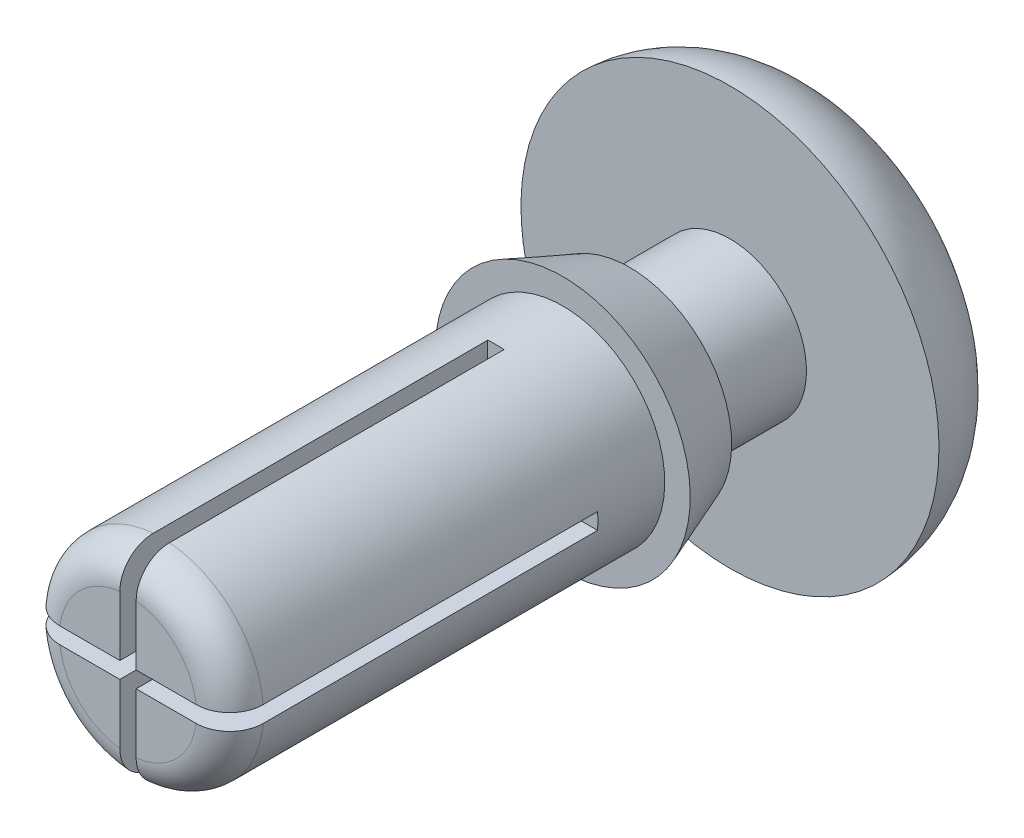
ISO-10303-21;
HEADER;
FILE_DESCRIPTION(('STEP AP214'),'2;1');
FILE_NAME('part.step','',(''),(''),'','','');
FILE_SCHEMA(('AUTOMOTIVE_DESIGN { 1 0 10303 214 1 1 1 1 }'));
ENDSEC;
DATA;
#1=APPLICATION_CONTEXT('core data for automotive mechanical design processes');
#2=APPLICATION_PROTOCOL_DEFINITION('international standard','automotive_design',2000,#1);
#3=PRODUCT_CONTEXT('',#1,'mechanical');
#4=PRODUCT('Part','Part','',(#3));
#5=PRODUCT_RELATED_PRODUCT_CATEGORY('part','',(#4));
#6=PRODUCT_DEFINITION_FORMATION('','',#4);
#7=PRODUCT_DEFINITION_CONTEXT('part definition',#1,'design');
#8=PRODUCT_DEFINITION('design','',#6,#7);
#9=PRODUCT_DEFINITION_SHAPE('','',#8);
#10=(LENGTH_UNIT() NAMED_UNIT(*) SI_UNIT(.MILLI.,.METRE.));
#11=(NAMED_UNIT(*) PLANE_ANGLE_UNIT() SI_UNIT($,.RADIAN.));
#12=(NAMED_UNIT(*) SI_UNIT($,.STERADIAN.) SOLID_ANGLE_UNIT());
#13=UNCERTAINTY_MEASURE_WITH_UNIT(LENGTH_MEASURE(1.E-05),#10,'distance_accuracy_value','');
#14=(GEOMETRIC_REPRESENTATION_CONTEXT(3) GLOBAL_UNCERTAINTY_ASSIGNED_CONTEXT((#13)) GLOBAL_UNIT_ASSIGNED_CONTEXT((#10,
#11,#12)) REPRESENTATION_CONTEXT('',''));
#15=CARTESIAN_POINT('',(0.,0.,0.));
#16=DIRECTION('',(0.,0.,1.));
#17=DIRECTION('',(1.,0.,0.));
#18=AXIS2_PLACEMENT_3D('',#15,#16,#17);
#19=CARTESIAN_POINT('',(0.,1.5494,6.604));
#20=DIRECTION('',(0.,0.,-1.));
#21=DIRECTION('',(0.,1.,0.));
#22=AXIS2_PLACEMENT_3D('',#19,#20,#21);
#23=PLANE('',#22);
#24=DIRECTION('',(1.,0.,0.));
#25=VECTOR('',#24,1.);
#26=CARTESIAN_POINT('',(0.,0.123952000000001,6.604));
#27=LINE('',#26,#25);
#28=CARTESIAN_POINT('',(0.123952,0.123952000000001,6.604));
#29=VERTEX_POINT('',#28);
#30=CARTESIAN_POINT('',(1.03399703176363,0.123952000000001,6.604));
#31=VERTEX_POINT('',#30);
#32=EDGE_CURVE('E339',#29,#31,#27,.T.);
#33=ORIENTED_EDGE('',*,*,#32,.T.);
#34=CARTESIAN_POINT('',(0.,0.,6.604));
#35=DIRECTION('',(0.,0.,-1.));
#36=DIRECTION('',(0.,1.,0.));
#37=AXIS2_PLACEMENT_3D('',#34,#35,#36);
#38=CIRCLE('',#37,1.0414);
#39=CARTESIAN_POINT('',(0.123952,1.03399703176363,6.604));
#40=VERTEX_POINT('',#39);
#41=EDGE_CURVE('E319',#31,#40,#38,.F.);
#42=ORIENTED_EDGE('',*,*,#41,.T.);
#43=DIRECTION('',(0.,-1.,0.));
#44=VECTOR('',#43,1.);
#45=CARTESIAN_POINT('',(0.123952,0.,6.604));
#46=LINE('',#45,#44);
#47=EDGE_CURVE('E338',#40,#29,#46,.T.);
#48=ORIENTED_EDGE('',*,*,#47,.T.);
#49=EDGE_LOOP('',(#33,#42,#48));
#50=FACE_BOUND('',#49,.T.);
#51=ADVANCED_FACE('F34',(#50),#23,.F.);
#52=DIRECTION('',(0.,-1.,0.));
#53=VECTOR('',#52,1.);
#54=CARTESIAN_POINT('',(0.123952,0.,6.604));
#55=LINE('',#54,#53);
#56=CARTESIAN_POINT('',(0.123952,-0.123951999999999,6.604));
#57=VERTEX_POINT('',#56);
#58=CARTESIAN_POINT('',(0.123952,-1.03399703176363,6.604));
#59=VERTEX_POINT('',#58);
#60=EDGE_CURVE('E353',#57,#59,#55,.T.);
#61=ORIENTED_EDGE('',*,*,#60,.T.);
#62=CARTESIAN_POINT('',(0.,0.,6.604));
#63=DIRECTION('',(0.,0.,-1.));
#64=DIRECTION('',(0.,1.,0.));
#65=AXIS2_PLACEMENT_3D('',#62,#63,#64);
#66=CIRCLE('',#65,1.0414);
#67=CARTESIAN_POINT('',(1.03399703176363,-0.123951999999999,6.604));
#68=VERTEX_POINT('',#67);
#69=EDGE_CURVE('E236',#59,#68,#66,.F.);
#70=ORIENTED_EDGE('',*,*,#69,.T.);
#71=DIRECTION('',(1.,0.,0.));
#72=VECTOR('',#71,1.);
#73=CARTESIAN_POINT('',(0.,-0.123951999999999,6.604));
#74=LINE('',#73,#72);
#75=EDGE_CURVE('E356',#57,#68,#74,.T.);
#76=ORIENTED_EDGE('',*,*,#75,.F.);
#77=EDGE_LOOP('',(#61,#70,#76));
#78=FACE_BOUND('',#77,.T.);
#79=ADVANCED_FACE('F369',(#78),#23,.F.);
#80=DIRECTION('',(0.,-1.,0.));
#81=VECTOR('',#80,1.);
#82=CARTESIAN_POINT('',(-0.123952,0.,6.604));
#83=LINE('',#82,#81);
#84=CARTESIAN_POINT('',(-0.123952,1.03399703176363,6.604));
#85=VERTEX_POINT('',#84);
#86=CARTESIAN_POINT('',(-0.123952,0.123952000000001,6.604));
#87=VERTEX_POINT('',#86);
#88=EDGE_CURVE('E179',#85,#87,#83,.T.);
#89=ORIENTED_EDGE('',*,*,#88,.F.);
#90=CARTESIAN_POINT('',(0.,0.,6.604));
#91=DIRECTION('',(0.,0.,-1.));
#92=DIRECTION('',(0.,1.,0.));
#93=AXIS2_PLACEMENT_3D('',#90,#91,#92);
#94=CIRCLE('',#93,1.0414);
#95=CARTESIAN_POINT('',(-1.03399703176363,0.123952000000001,6.604));
#96=VERTEX_POINT('',#95);
#97=EDGE_CURVE('E391',#85,#96,#94,.F.);
#98=ORIENTED_EDGE('',*,*,#97,.T.);
#99=DIRECTION('',(1.,0.,0.));
#100=VECTOR('',#99,1.);
#101=CARTESIAN_POINT('',(0.,0.123952000000001,6.604));
#102=LINE('',#101,#100);
#103=EDGE_CURVE('E343',#96,#87,#102,.T.);
#104=ORIENTED_EDGE('',*,*,#103,.T.);
#105=EDGE_LOOP('',(#89,#98,#104));
#106=FACE_BOUND('',#105,.T.);
#107=ADVANCED_FACE('F396',(#106),#23,.F.);
#108=CARTESIAN_POINT('',(0.,0.,6.604));
#109=DIRECTION('',(0.,0.,1.));
#110=DIRECTION('',(0.,-1.,0.));
#111=AXIS2_PLACEMENT_3D('',#108,#109,#110);
#112=CYLINDRICAL_SURFACE('',#111,1.5494);
#113=CARTESIAN_POINT('',(0.,0.,0.));
#114=DIRECTION('',(0.,0.,1.));
#115=DIRECTION('',(0.,-1.,0.));
#116=AXIS2_PLACEMENT_3D('',#113,#114,#115);
#117=CIRCLE('',#116,1.5494);
#118=CARTESIAN_POINT('',(0.,-1.5494,0.));
#119=VERTEX_POINT('',#118);
#120=EDGE_CURVE('E211',#119,#119,#117,.T.);
#121=ORIENTED_EDGE('',*,*,#120,.T.);
#122=EDGE_LOOP('',(#121));
#123=FACE_BOUND('',#122,.T.);
#124=DIRECTION('',(0.,0.,1.));
#125=VECTOR('',#124,1.);
#126=CARTESIAN_POINT('',(1.54443396158463,-0.123951999999999,6.604));
#127=LINE('',#126,#125);
#128=CARTESIAN_POINT('',(1.54443396158463,-0.123951999999999,1.016));
#129=VERTEX_POINT('',#128);
#130=CARTESIAN_POINT('',(1.54443396158463,-0.123951999999999,6.096));
#131=VERTEX_POINT('',#130);
#132=EDGE_CURVE('E216',#129,#131,#127,.T.);
#133=ORIENTED_EDGE('',*,*,#132,.T.);
#134=CARTESIAN_POINT('',(0.,0.,6.096));
#135=DIRECTION('',(0.,0.,-1.));
#136=DIRECTION('',(0.,1.,0.));
#137=AXIS2_PLACEMENT_3D('',#134,#135,#136);
#138=CIRCLE('',#137,1.5494);
#139=CARTESIAN_POINT('',(0.123952,-1.54443396158463,6.096));
#140=VERTEX_POINT('',#139);
#141=EDGE_CURVE('E278',#131,#140,#138,.T.);
#142=ORIENTED_EDGE('',*,*,#141,.T.);
#143=DIRECTION('',(0.,0.,1.));
#144=VECTOR('',#143,1.);
#145=CARTESIAN_POINT('',(0.123952,-1.54443396158463,6.604));
#146=LINE('',#145,#144);
#147=CARTESIAN_POINT('',(0.123952,-1.54443396158463,1.016));
#148=VERTEX_POINT('',#147);
#149=EDGE_CURVE('E225',#148,#140,#146,.T.);
#150=ORIENTED_EDGE('',*,*,#149,.F.);
#151=CARTESIAN_POINT('',(0.,0.,1.016));
#152=DIRECTION('',(0.,0.,1.));
#153=DIRECTION('',(1.,0.,0.));
#154=AXIS2_PLACEMENT_3D('',#151,#152,#153);
#155=CIRCLE('',#154,1.5494);
#156=CARTESIAN_POINT('',(-0.123952,-1.54443396158463,1.016));
#157=VERTEX_POINT('',#156);
#158=EDGE_CURVE('E217',#157,#148,#155,.T.);
#159=ORIENTED_EDGE('',*,*,#158,.F.);
#160=DIRECTION('',(0.,0.,1.));
#161=VECTOR('',#160,1.);
#162=CARTESIAN_POINT('',(-0.123952,-1.54443396158463,6.604));
#163=LINE('',#162,#161);
#164=CARTESIAN_POINT('',(-0.123952,-1.54443396158463,6.096));
#165=VERTEX_POINT('',#164);
#166=EDGE_CURVE('E222',#157,#165,#163,.T.);
#167=ORIENTED_EDGE('',*,*,#166,.T.);
#168=CARTESIAN_POINT('',(0.,0.,6.096));
#169=DIRECTION('',(0.,0.,-1.));
#170=DIRECTION('',(0.,1.,0.));
#171=AXIS2_PLACEMENT_3D('',#168,#169,#170);
#172=CIRCLE('',#171,1.5494);
#173=CARTESIAN_POINT('',(-1.54443396158463,-0.123951999999999,6.096));
#174=VERTEX_POINT('',#173);
#175=EDGE_CURVE('E379',#165,#174,#172,.T.);
#176=ORIENTED_EDGE('',*,*,#175,.T.);
#177=DIRECTION('',(0.,0.,1.));
#178=VECTOR('',#177,1.);
#179=CARTESIAN_POINT('',(-1.54443396158463,-0.123951999999999,6.604));
#180=LINE('',#179,#178);
#181=CARTESIAN_POINT('',(-1.54443396158463,-0.123951999999999,1.016));
#182=VERTEX_POINT('',#181);
#183=EDGE_CURVE('E230',#174,#182,#180,.F.);
#184=ORIENTED_EDGE('',*,*,#183,.T.);
#185=CARTESIAN_POINT('',(-1.54443396158463,0.123952000000001,1.016));
#186=VERTEX_POINT('',#185);
#187=EDGE_CURVE('E228',#186,#182,#155,.T.);
#188=ORIENTED_EDGE('',*,*,#187,.F.);
#189=DIRECTION('',(0.,0.,1.));
#190=VECTOR('',#189,1.);
#191=CARTESIAN_POINT('',(-1.54443396158463,0.123952000000001,6.604));
#192=LINE('',#191,#190);
#193=CARTESIAN_POINT('',(-1.54443396158463,0.123952000000001,6.096));
#194=VERTEX_POINT('',#193);
#195=EDGE_CURVE('E174',#194,#186,#192,.F.);
#196=ORIENTED_EDGE('',*,*,#195,.F.);
#197=CARTESIAN_POINT('',(0.,0.,6.096));
#198=DIRECTION('',(0.,0.,-1.));
#199=DIRECTION('',(0.,1.,0.));
#200=AXIS2_PLACEMENT_3D('',#197,#198,#199);
#201=CIRCLE('',#200,1.5494);
#202=CARTESIAN_POINT('',(-0.123952,1.54443396158463,6.096));
#203=VERTEX_POINT('',#202);
#204=EDGE_CURVE('E378',#194,#203,#201,.T.);
#205=ORIENTED_EDGE('',*,*,#204,.T.);
#206=DIRECTION('',(0.,0.,1.));
#207=VECTOR('',#206,1.);
#208=CARTESIAN_POINT('',(-0.123952,1.54443396158463,6.604));
#209=LINE('',#208,#207);
#210=CARTESIAN_POINT('',(-0.123952,1.54443396158463,1.016));
#211=VERTEX_POINT('',#210);
#212=EDGE_CURVE('E232',#203,#211,#209,.F.);
#213=ORIENTED_EDGE('',*,*,#212,.T.);
#214=CARTESIAN_POINT('',(0.123952,1.54443396158463,1.016));
#215=VERTEX_POINT('',#214);
#216=EDGE_CURVE('E162',#215,#211,#155,.T.);
#217=ORIENTED_EDGE('',*,*,#216,.F.);
#218=DIRECTION('',(0.,0.,1.));
#219=VECTOR('',#218,1.);
#220=CARTESIAN_POINT('',(0.123952,1.54443396158463,6.604));
#221=LINE('',#220,#219);
#222=CARTESIAN_POINT('',(0.123952,1.54443396158463,6.096));
#223=VERTEX_POINT('',#222);
#224=EDGE_CURVE('E234',#223,#215,#221,.F.);
#225=ORIENTED_EDGE('',*,*,#224,.F.);
#226=CARTESIAN_POINT('',(0.,0.,6.096));
#227=DIRECTION('',(0.,0.,-1.));
#228=DIRECTION('',(0.,1.,0.));
#229=AXIS2_PLACEMENT_3D('',#226,#227,#228);
#230=CIRCLE('',#229,1.5494);
#231=CARTESIAN_POINT('',(1.54443396158463,0.123952000000001,6.096));
#232=VERTEX_POINT('',#231);
#233=EDGE_CURVE('E247',#223,#232,#230,.T.);
#234=ORIENTED_EDGE('',*,*,#233,.T.);
#235=DIRECTION('',(0.,0.,1.));
#236=VECTOR('',#235,1.);
#237=CARTESIAN_POINT('',(1.54443396158463,0.123952000000001,6.604));
#238=LINE('',#237,#236);
#239=CARTESIAN_POINT('',(1.54443396158463,0.123952000000001,1.016));
#240=VERTEX_POINT('',#239);
#241=EDGE_CURVE('E220',#240,#232,#238,.T.);
#242=ORIENTED_EDGE('',*,*,#241,.F.);
#243=EDGE_CURVE('E214',#129,#240,#155,.T.);
#244=ORIENTED_EDGE('',*,*,#243,.F.);
#245=EDGE_LOOP('',(#133,#142,#150,#159,#167,#176,#184,#188,#196,#205,#213,#217,#225,#234,#242,#244));
#246=FACE_BOUND('',#245,.T.);
#247=ADVANCED_FACE('F374',(#123,#246),#112,.T.);
#248=CARTESIAN_POINT('',(0.,1.5875,-4.064));
#249=DIRECTION('',(0.,0.,1.));
#250=DIRECTION('',(0.,-1.,0.));
#251=AXIS2_PLACEMENT_3D('',#248,#249,#250);
#252=PLANE('',#251);
#253=CARTESIAN_POINT('',(0.,0.,-4.064));
#254=DIRECTION('',(0.,0.,1.));
#255=DIRECTION('',(0.,-1.,0.));
#256=AXIS2_PLACEMENT_3D('',#253,#254,#255);
#257=CIRCLE('',#256,1.5875);
#258=CARTESIAN_POINT('',(0.,-1.5875,-4.064));
#259=VERTEX_POINT('',#258);
#260=EDGE_CURVE('E192',#259,#259,#257,.T.);
#261=ORIENTED_EDGE('',*,*,#260,.F.);
#262=EDGE_LOOP('',(#261));
#263=FACE_BOUND('',#262,.T.);
#264=ADVANCED_FACE('F404',(#263),#252,.F.);
#265=DIRECTION('',(1.,0.,0.));
#266=VECTOR('',#265,1.);
#267=CARTESIAN_POINT('',(0.,-0.123951999999999,6.604));
#268=LINE('',#267,#266);
#269=CARTESIAN_POINT('',(-1.03399703176363,-0.123951999999999,6.604));
#270=VERTEX_POINT('',#269);
#271=CARTESIAN_POINT('',(-0.123952,-0.123951999999999,6.604));
#272=VERTEX_POINT('',#271);
#273=EDGE_CURVE('E348',#270,#272,#268,.T.);
#274=ORIENTED_EDGE('',*,*,#273,.F.);
#275=CARTESIAN_POINT('',(0.,0.,6.604));
#276=DIRECTION('',(0.,0.,-1.));
#277=DIRECTION('',(0.,1.,0.));
#278=AXIS2_PLACEMENT_3D('',#275,#276,#277);
#279=CIRCLE('',#278,1.0414);
#280=CARTESIAN_POINT('',(-0.123952,-1.03399703176363,6.604));
#281=VERTEX_POINT('',#280);
#282=EDGE_CURVE('E277',#270,#281,#279,.F.);
#283=ORIENTED_EDGE('',*,*,#282,.T.);
#284=DIRECTION('',(0.,-1.,0.));
#285=VECTOR('',#284,1.);
#286=CARTESIAN_POINT('',(-0.123952,0.,6.604));
#287=LINE('',#286,#285);
#288=EDGE_CURVE('E350',#272,#281,#287,.T.);
#289=ORIENTED_EDGE('',*,*,#288,.F.);
#290=EDGE_LOOP('',(#274,#283,#289));
#291=FACE_BOUND('',#290,.T.);
#292=ADVANCED_FACE('F399',(#291),#23,.F.);
#293=CARTESIAN_POINT('',(0.,1.93675,0.));
#294=DIRECTION('',(0.,0.,-1.));
#295=DIRECTION('',(0.,1.,0.));
#296=AXIS2_PLACEMENT_3D('',#293,#294,#295);
#297=PLANE('',#296);
#298=ORIENTED_EDGE('',*,*,#120,.F.);
#299=EDGE_LOOP('',(#298));
#300=FACE_BOUND('',#299,.T.);
#301=CARTESIAN_POINT('',(0.,0.,0.));
#302=DIRECTION('',(0.,0.,1.));
#303=DIRECTION('',(0.,-1.,0.));
#304=AXIS2_PLACEMENT_3D('',#301,#302,#303);
#305=CIRCLE('',#304,1.93675);
#306=CARTESIAN_POINT('',(0.,-1.93675,0.));
#307=VERTEX_POINT('',#306);
#308=EDGE_CURVE('E208',#307,#307,#305,.T.);
#309=ORIENTED_EDGE('',*,*,#308,.T.);
#310=EDGE_LOOP('',(#309));
#311=FACE_BOUND('',#310,.T.);
#312=ADVANCED_FACE('F408',(#300,#311),#297,.F.);
#313=CARTESIAN_POINT('',(0.,0.,-1.016));
#314=DIRECTION('',(0.,0.,1.));
#315=DIRECTION('',(0.,-1.,0.));
#316=AXIS2_PLACEMENT_3D('',#313,#314,#315);
#317=CONICAL_SURFACE('',#316,1.5494,0.364238831763668);
#318=ORIENTED_EDGE('',*,*,#308,.F.);
#319=EDGE_LOOP('',(#318));
#320=FACE_BOUND('',#319,.T.);
#321=CARTESIAN_POINT('',(0.,0.,-1.016));
#322=DIRECTION('',(0.,0.,1.));
#323=DIRECTION('',(0.,-1.,0.));
#324=AXIS2_PLACEMENT_3D('',#321,#322,#323);
#325=CIRCLE('',#324,1.5494);
#326=CARTESIAN_POINT('',(0.,-1.5494,-1.016));
#327=VERTEX_POINT('',#326);
#328=EDGE_CURVE('E205',#327,#327,#325,.T.);
#329=ORIENTED_EDGE('',*,*,#328,.T.);
#330=EDGE_LOOP('',(#329));
#331=FACE_BOUND('',#330,.T.);
#332=ADVANCED_FACE('F562',(#320,#331),#317,.T.);
#333=CARTESIAN_POINT('',(0.,1.16205,-1.016));
#334=DIRECTION('',(0.,0.,1.));
#335=DIRECTION('',(0.,-1.,0.));
#336=AXIS2_PLACEMENT_3D('',#333,#334,#335);
#337=PLANE('',#336);
#338=ORIENTED_EDGE('',*,*,#328,.F.);
#339=EDGE_LOOP('',(#338));
#340=FACE_BOUND('',#339,.T.);
#341=CARTESIAN_POINT('',(0.,0.,-1.016));
#342=DIRECTION('',(0.,0.,1.));
#343=DIRECTION('',(0.,-1.,0.));
#344=AXIS2_PLACEMENT_3D('',#341,#342,#343);
#345=CIRCLE('',#344,1.16205);
#346=CARTESIAN_POINT('',(0.,-1.16205,-1.016));
#347=VERTEX_POINT('',#346);
#348=EDGE_CURVE('E202',#347,#347,#345,.T.);
#349=ORIENTED_EDGE('',*,*,#348,.T.);
#350=EDGE_LOOP('',(#349));
#351=FACE_BOUND('',#350,.T.);
#352=ADVANCED_FACE('F552',(#340,#351),#337,.F.);
#353=CARTESIAN_POINT('',(0.,0.,6.604));
#354=DIRECTION('',(0.,0.,1.));
#355=DIRECTION('',(0.,-1.,0.));
#356=AXIS2_PLACEMENT_3D('',#353,#354,#355);
#357=CYLINDRICAL_SURFACE('',#356,1.16205);
#358=ORIENTED_EDGE('',*,*,#348,.F.);
#359=EDGE_LOOP('',(#358));
#360=FACE_BOUND('',#359,.T.);
#361=CARTESIAN_POINT('',(0.,0.,-2.54));
#362=DIRECTION('',(0.,0.,1.));
#363=DIRECTION('',(0.,-1.,0.));
#364=AXIS2_PLACEMENT_3D('',#361,#362,#363);
#365=CIRCLE('',#364,1.16205);
#366=CARTESIAN_POINT('',(0.,-1.16205,-2.54));
#367=VERTEX_POINT('',#366);
#368=EDGE_CURVE('E199',#367,#367,#365,.T.);
#369=ORIENTED_EDGE('',*,*,#368,.T.);
#370=EDGE_LOOP('',(#369));
#371=FACE_BOUND('',#370,.T.);
#372=ADVANCED_FACE('F543',(#360,#371),#357,.T.);
#373=CARTESIAN_POINT('',(0.,3.175,-2.54));
#374=DIRECTION('',(0.,0.,-1.));
#375=DIRECTION('',(0.,1.,0.));
#376=AXIS2_PLACEMENT_3D('',#373,#374,#375);
#377=PLANE('',#376);
#378=ORIENTED_EDGE('',*,*,#368,.F.);
#379=EDGE_LOOP('',(#378));
#380=FACE_BOUND('',#379,.T.);
#381=CARTESIAN_POINT('',(0.,0.,-2.54));
#382=DIRECTION('',(0.,0.,1.));
#383=DIRECTION('',(0.,-1.,0.));
#384=AXIS2_PLACEMENT_3D('',#381,#382,#383);
#385=CIRCLE('',#384,3.175);
#386=CARTESIAN_POINT('',(0.,-3.175,-2.54));
#387=VERTEX_POINT('',#386);
#388=EDGE_CURVE('E195',#387,#387,#385,.T.);
#389=ORIENTED_EDGE('',*,*,#388,.T.);
#390=EDGE_LOOP('',(#389));
#391=FACE_BOUND('',#390,.T.);
#392=ADVANCED_FACE('F534',(#380,#391),#377,.F.);
#393=CARTESIAN_POINT('',(0.,0.,-2.47517708333333));
#394=DIRECTION('',(0.,0.,1.));
#395=DIRECTION('',(0.,-1.,0.));
#396=AXIS2_PLACEMENT_3D('',#393,#394,#395);
#397=DEGENERATE_TOROIDAL_SURFACE('',#396,1.5875,1.58882291666667,.T.);
#398=ORIENTED_EDGE('',*,*,#388,.F.);
#399=EDGE_LOOP('',(#398));
#400=FACE_BOUND('',#399,.T.);
#401=ORIENTED_EDGE('',*,*,#260,.T.);
#402=EDGE_LOOP('',(#401));
#403=FACE_BOUND('',#402,.T.);
#404=ADVANCED_FACE('F328',(#400,#403),#397,.T.);
#405=CARTESIAN_POINT('',(0.123952,0.,1.016));
#406=DIRECTION('',(-1.,0.,0.));
#407=DIRECTION('',(0.,0.,1.));
#408=AXIS2_PLACEMENT_3D('',#405,#406,#407);
#409=PLANE('',#408);
#410=ORIENTED_EDGE('',*,*,#47,.F.);
#411=CARTESIAN_POINT('',(0.123952,1.03399703176363,6.604));
#412=CARTESIAN_POINT('',(0.123952,1.06283273116659,6.60402482893017));
#413=CARTESIAN_POINT('',(0.123952,1.09166420990576,6.60158092743518));
#414=CARTESIAN_POINT('',(0.123952,1.14850002839351,6.59191870748701));
#415=CARTESIAN_POINT('',(0.123952,1.17650481500354,6.58470301964545));
#416=CARTESIAN_POINT('',(0.123952,1.23091952370238,6.56565383936896));
#417=CARTESIAN_POINT('',(0.123952,1.25732841182211,6.55381738945009));
#418=CARTESIAN_POINT('',(0.123952,1.30776533212002,6.52586364353388));
#419=CARTESIAN_POINT('',(0.123952,1.33179398415613,6.50974746610287));
#420=CARTESIAN_POINT('',(0.123952,1.37668137694529,6.47376435601444));
#421=CARTESIAN_POINT('',(0.123952,1.39755366125537,6.45391431915702));
#422=CARTESIAN_POINT('',(0.123952,1.4356561295158,6.41097314114025));
#423=CARTESIAN_POINT('',(0.123952,1.45288558911708,6.38788135689921));
#424=CARTESIAN_POINT('',(0.123952,1.48313281201734,6.3392237494209));
#425=CARTESIAN_POINT('',(0.123952,1.49616781842471,6.31366863131571));
#426=CARTESIAN_POINT('',(0.123952,1.51774235977157,6.26073436905663));
#427=CARTESIAN_POINT('',(0.123952,1.52628477072618,6.23335640450974));
#428=CARTESIAN_POINT('',(0.123952,1.53643945658233,6.18750025863813));
#429=CARTESIAN_POINT('',(0.123952,1.53943567573503,6.16931667353443));
#430=CARTESIAN_POINT('',(0.123952,1.5434325679002,6.13275799448274));
#431=CARTESIAN_POINT('',(0.123952,1.5444361018787,6.1143832132267));
#432=CARTESIAN_POINT('',(0.123952,1.54443396158463,6.096));
#433=B_SPLINE_CURVE_WITH_KNOTS('',3,(#411,#412,#413,#414,#415,#416,#417,#418,#419,#420,#421,
#422,#423,#424,#425,#426,#427,#428,#429,#430,#431,#432),.UNSPECIFIED.,.F.,.F.,(4,2,2,2,2,2,2,2,
2,2,4),(0.,0.0863977700313253,0.17274794997644,0.259153488555823,0.34553646603467,
0.431537572846793,0.517555764300906,0.603215684139134,0.688820700296315,0.744005816427193,
0.799111643952221),.UNSPECIFIED.);
#434=EDGE_CURVE('E48',#40,#223,#433,.T.);
#435=ORIENTED_EDGE('',*,*,#434,.T.);
#436=ORIENTED_EDGE('',*,*,#224,.T.);
#437=DIRECTION('',(0.,-1.,0.));
#438=VECTOR('',#437,1.);
#439=CARTESIAN_POINT('',(0.123952,0.,1.016));
#440=LINE('',#439,#438);
#441=CARTESIAN_POINT('',(0.123952,0.123952000000001,1.016));
#442=VERTEX_POINT('',#441);
#443=EDGE_CURVE('E166',#215,#442,#440,.T.);
#444=ORIENTED_EDGE('',*,*,#443,.T.);
#445=DIRECTION('',(0.,0.,1.));
#446=VECTOR('',#445,1.);
#447=CARTESIAN_POINT('',(0.123952,0.123952000000001,1.016));
#448=LINE('',#447,#446);
#449=EDGE_CURVE('E196',#442,#29,#448,.T.);
#450=ORIENTED_EDGE('',*,*,#449,.T.);
#451=EDGE_LOOP('',(#410,#435,#436,#444,#450));
#452=FACE_BOUND('',#451,.T.);
#453=ADVANCED_FACE('F324',(#452),#409,.T.);
#454=CARTESIAN_POINT('',(0.,0.123952000000001,1.016));
#455=DIRECTION('',(0.,-1.,0.));
#456=DIRECTION('',(0.,0.,-1.));
#457=AXIS2_PLACEMENT_3D('',#454,#455,#456);
#458=PLANE('',#457);
#459=ORIENTED_EDGE('',*,*,#241,.T.);
#460=CARTESIAN_POINT('',(1.54443396158463,0.123952000000001,6.096));
#461=CARTESIAN_POINT('',(1.54445849180631,0.123952000000001,6.12450584479577));
#462=CARTESIAN_POINT('',(1.54202837061674,0.123952000000001,6.15300406473306));
#463=CARTESIAN_POINT('',(1.53244026996858,0.123952000000001,6.2091697615398));
#464=CARTESIAN_POINT('',(1.52528634385418,0.123952000000001,6.23683792939002));
#465=CARTESIAN_POINT('',(1.50642718968069,0.123952000000001,6.29059190688386));
#466=CARTESIAN_POINT('',(1.49471987787404,0.123952000000001,6.31667698573765));
#467=CARTESIAN_POINT('',(1.46710012618487,0.123952000000001,6.3665105013212));
#468=CARTESIAN_POINT('',(1.45118833981936,0.123952000000001,6.39025930040099));
#469=CARTESIAN_POINT('',(1.41559302474478,0.123952000000001,6.43478060631104));
#470=CARTESIAN_POINT('',(1.3959054262299,0.123952000000001,6.45554985898753));
#471=CARTESIAN_POINT('',(1.3533282044282,0.123952000000001,6.49350396522998));
#472=CARTESIAN_POINT('',(1.3304379939173,0.123952000000001,6.51068816000469));
#473=CARTESIAN_POINT('',(1.28203397842585,0.123952000000001,6.54104068239334));
#474=CARTESIAN_POINT('',(1.25651195698254,0.123952000000001,6.55419589103744));
#475=CARTESIAN_POINT('',(1.20363269334371,0.123952000000001,6.57605206564235));
#476=CARTESIAN_POINT('',(1.17627634145429,0.123952000000001,6.58475517501501));
#477=CARTESIAN_POINT('',(1.12963906652602,0.123952000000001,6.59540241636696));
#478=CARTESIAN_POINT('',(1.11063996142858,0.123952000000001,6.59862582428916));
#479=CARTESIAN_POINT('',(1.07242860845556,0.123952000000001,6.60292442128467));
#480=CARTESIAN_POINT('',(1.05321671595056,0.123952000000001,6.6040027691873));
#481=CARTESIAN_POINT('',(1.03399703176363,0.123952000000001,6.604));
#482=B_SPLINE_CURVE_WITH_KNOTS('',3,(#460,#461,#462,#463,#464,#465,#466,#467,#468,#469,#470,
#471,#472,#473,#474,#475,#476,#477,#478,#479,#480,#481),.UNSPECIFIED.,.F.,.F.,(4,2,2,2,2,2,2,2,
2,2,4),(0.,0.0854031376340935,0.170733088662268,0.256102134925247,0.341457919759495,
0.426906228765319,0.512370225973161,0.598109618248381,0.683807693341555,0.741506125600271,
0.799119527685795),.UNSPECIFIED.);
#483=EDGE_CURVE('E11',#232,#31,#482,.T.);
#484=ORIENTED_EDGE('',*,*,#483,.T.);
#485=ORIENTED_EDGE('',*,*,#32,.F.);
#486=ORIENTED_EDGE('',*,*,#449,.F.);
#487=DIRECTION('',(1.,0.,0.));
#488=VECTOR('',#487,1.);
#489=CARTESIAN_POINT('',(0.,0.123952000000001,1.016));
#490=LINE('',#489,#488);
#491=EDGE_CURVE('E182',#442,#240,#490,.T.);
#492=ORIENTED_EDGE('',*,*,#491,.T.);
#493=EDGE_LOOP('',(#459,#484,#485,#486,#492));
#494=FACE_BOUND('',#493,.T.);
#495=ADVANCED_FACE('F258',(#494),#458,.T.);
#496=CARTESIAN_POINT('',(0.,-0.123951999999999,1.016));
#497=DIRECTION('',(0.,-1.,0.));
#498=DIRECTION('',(0.,0.,-1.));
#499=AXIS2_PLACEMENT_3D('',#496,#497,#498);
#500=PLANE('',#499);
#501=ORIENTED_EDGE('',*,*,#75,.T.);
#502=CARTESIAN_POINT('',(1.03399703176363,-0.123951999999999,6.604));
#503=CARTESIAN_POINT('',(1.06283273116659,-0.123951999999999,6.60402482893017));
#504=CARTESIAN_POINT('',(1.09166420990576,-0.123951999999999,6.60158092743518));
#505=CARTESIAN_POINT('',(1.14850002839351,-0.123951999999999,6.59191870748701));
#506=CARTESIAN_POINT('',(1.17650481500354,-0.123951999999999,6.58470301964545));
#507=CARTESIAN_POINT('',(1.23091952370238,-0.123951999999999,6.56565383936896));
#508=CARTESIAN_POINT('',(1.25732841182212,-0.123951999999999,6.55381738945009));
#509=CARTESIAN_POINT('',(1.30776533212002,-0.123951999999999,6.52586364353388));
#510=CARTESIAN_POINT('',(1.33179398415613,-0.123951999999999,6.50974746610287));
#511=CARTESIAN_POINT('',(1.37668137694529,-0.123951999999999,6.47376435601444));
#512=CARTESIAN_POINT('',(1.39755366125537,-0.123951999999999,6.45391431915702));
#513=CARTESIAN_POINT('',(1.4356561295158,-0.123951999999999,6.41097314114025));
#514=CARTESIAN_POINT('',(1.45288558911709,-0.123951999999999,6.38788135689921));
#515=CARTESIAN_POINT('',(1.48313281201735,-0.123951999999999,6.3392237494209));
#516=CARTESIAN_POINT('',(1.49616781842471,-0.123951999999999,6.31366863131571));
#517=CARTESIAN_POINT('',(1.51774235977157,-0.123951999999999,6.26073436905663));
#518=CARTESIAN_POINT('',(1.52628477072618,-0.123951999999999,6.23335640450974));
#519=CARTESIAN_POINT('',(1.53643945658233,-0.123951999999999,6.18750025863813));
#520=CARTESIAN_POINT('',(1.53943567573503,-0.123951999999999,6.16931667353443));
#521=CARTESIAN_POINT('',(1.54343256790021,-0.123951999999999,6.13275799448274));
#522=CARTESIAN_POINT('',(1.5444361018787,-0.123951999999999,6.1143832132267));
#523=CARTESIAN_POINT('',(1.54443396158463,-0.123951999999999,6.096));
#524=B_SPLINE_CURVE_WITH_KNOTS('',3,(#502,#503,#504,#505,#506,#507,#508,#509,#510,#511,#512,
#513,#514,#515,#516,#517,#518,#519,#520,#521,#522,#523),.UNSPECIFIED.,.F.,.F.,(4,2,2,2,2,2,2,2,
2,2,4),(0.,0.0863977700313248,0.17274794997644,0.259153488555824,0.34553646603467,
0.431537572846792,0.517555764300906,0.603215684139133,0.688820700296315,0.744005816427194,
0.79911164395222),.UNSPECIFIED.);
#525=EDGE_CURVE('E239',#68,#131,#524,.T.);
#526=ORIENTED_EDGE('',*,*,#525,.T.);
#527=ORIENTED_EDGE('',*,*,#132,.F.);
#528=DIRECTION('',(1.,0.,0.));
#529=VECTOR('',#528,1.);
#530=CARTESIAN_POINT('',(0.,-0.123951999999999,1.016));
#531=LINE('',#530,#529);
#532=CARTESIAN_POINT('',(0.123952,-0.123951999999999,1.016));
#533=VERTEX_POINT('',#532);
#534=EDGE_CURVE('E188',#533,#129,#531,.T.);
#535=ORIENTED_EDGE('',*,*,#534,.F.);
#536=DIRECTION('',(0.,0.,1.));
#537=VECTOR('',#536,1.);
#538=CARTESIAN_POINT('',(0.123952,-0.123951999999999,1.016));
#539=LINE('',#538,#537);
#540=EDGE_CURVE('E185',#533,#57,#539,.T.);
#541=ORIENTED_EDGE('',*,*,#540,.T.);
#542=EDGE_LOOP('',(#501,#526,#527,#535,#541));
#543=FACE_BOUND('',#542,.T.);
#544=ADVANCED_FACE('F253',(#543),#500,.F.);
#545=CARTESIAN_POINT('',(0.123952,0.,1.016));
#546=DIRECTION('',(-1.,0.,0.));
#547=DIRECTION('',(0.,0.,1.));
#548=AXIS2_PLACEMENT_3D('',#545,#546,#547);
#549=PLANE('',#548);
#550=ORIENTED_EDGE('',*,*,#149,.T.);
#551=CARTESIAN_POINT('',(0.123952,-1.54443396158463,6.096));
#552=CARTESIAN_POINT('',(0.123952,-1.54445849180632,6.12450584479577));
#553=CARTESIAN_POINT('',(0.123952,-1.54202837061674,6.15300406473306));
#554=CARTESIAN_POINT('',(0.123952,-1.53244026996858,6.2091697615398));
#555=CARTESIAN_POINT('',(0.123952,-1.52528634385418,6.23683792939002));
#556=CARTESIAN_POINT('',(0.123952,-1.50642718968069,6.29059190688386));
#557=CARTESIAN_POINT('',(0.123952,-1.49471987787404,6.31667698573765));
#558=CARTESIAN_POINT('',(0.123952,-1.46710012618487,6.3665105013212));
#559=CARTESIAN_POINT('',(0.123952,-1.45118833981936,6.39025930040099));
#560=CARTESIAN_POINT('',(0.123952,-1.41559302474478,6.43478060631104));
#561=CARTESIAN_POINT('',(0.123952,-1.3959054262299,6.45554985898753));
#562=CARTESIAN_POINT('',(0.123952,-1.3533282044282,6.49350396522998));
#563=CARTESIAN_POINT('',(0.123952,-1.3304379939173,6.51068816000469));
#564=CARTESIAN_POINT('',(0.123952,-1.28203397842585,6.54104068239334));
#565=CARTESIAN_POINT('',(0.123952,-1.25651195698254,6.55419589103744));
#566=CARTESIAN_POINT('',(0.123952,-1.20363269334371,6.57605206564235));
#567=CARTESIAN_POINT('',(0.123952,-1.1762763414543,6.58475517501501));
#568=CARTESIAN_POINT('',(0.123952,-1.12963906652602,6.59540241636696));
#569=CARTESIAN_POINT('',(0.123952,-1.11063996142858,6.59862582428916));
#570=CARTESIAN_POINT('',(0.123952,-1.07242860845556,6.60292442128467));
#571=CARTESIAN_POINT('',(0.123952,-1.05321671595056,6.6040027691873));
#572=CARTESIAN_POINT('',(0.123952,-1.03399703176363,6.604));
#573=B_SPLINE_CURVE_WITH_KNOTS('',3,(#551,#552,#553,#554,#555,#556,#557,#558,#559,#560,#561,
#562,#563,#564,#565,#566,#567,#568,#569,#570,#571,#572),.UNSPECIFIED.,.F.,.F.,(4,2,2,2,2,2,2,2,
2,2,4),(0.,0.0854031376340944,0.170733088662268,0.256102134925247,0.341457919759494,
0.426906228765319,0.512370225973161,0.598109618248381,0.683807693341555,0.741506125600271,
0.799119527685795),.UNSPECIFIED.);
#574=EDGE_CURVE('E270',#140,#59,#573,.T.);
#575=ORIENTED_EDGE('',*,*,#574,.T.);
#576=ORIENTED_EDGE('',*,*,#60,.F.);
#577=ORIENTED_EDGE('',*,*,#540,.F.);
#578=DIRECTION('',(0.,-1.,0.));
#579=VECTOR('',#578,1.);
#580=CARTESIAN_POINT('',(0.123952,0.,1.016));
#581=LINE('',#580,#579);
#582=EDGE_CURVE('E626',#533,#148,#581,.T.);
#583=ORIENTED_EDGE('',*,*,#582,.T.);
#584=EDGE_LOOP('',(#550,#575,#576,#577,#583));
#585=FACE_BOUND('',#584,.T.);
#586=ADVANCED_FACE('F257',(#585),#549,.T.);
#587=CARTESIAN_POINT('',(-0.123952,0.,1.016));
#588=DIRECTION('',(-1.,0.,0.));
#589=DIRECTION('',(0.,0.,1.));
#590=AXIS2_PLACEMENT_3D('',#587,#588,#589);
#591=PLANE('',#590);
#592=ORIENTED_EDGE('',*,*,#288,.T.);
#593=CARTESIAN_POINT('',(-0.123952,-1.03399703176363,6.604));
#594=CARTESIAN_POINT('',(-0.123952,-1.06283273116659,6.60402482893017));
#595=CARTESIAN_POINT('',(-0.123952,-1.09166420990576,6.60158092743518));
#596=CARTESIAN_POINT('',(-0.123952,-1.14850002839351,6.59191870748701));
#597=CARTESIAN_POINT('',(-0.123952,-1.17650481500354,6.58470301964545));
#598=CARTESIAN_POINT('',(-0.123952,-1.23091952370238,6.56565383936896));
#599=CARTESIAN_POINT('',(-0.123952,-1.25732841182212,6.55381738945009));
#600=CARTESIAN_POINT('',(-0.123952,-1.30776533212002,6.52586364353388));
#601=CARTESIAN_POINT('',(-0.123952,-1.33179398415613,6.50974746610287));
#602=CARTESIAN_POINT('',(-0.123952,-1.37668137694529,6.47376435601444));
#603=CARTESIAN_POINT('',(-0.123952,-1.39755366125537,6.45391431915702));
#604=CARTESIAN_POINT('',(-0.123952,-1.4356561295158,6.41097314114025));
#605=CARTESIAN_POINT('',(-0.123952,-1.45288558911709,6.38788135689921));
#606=CARTESIAN_POINT('',(-0.123952,-1.48313281201735,6.3392237494209));
#607=CARTESIAN_POINT('',(-0.123952,-1.49616781842471,6.31366863131571));
#608=CARTESIAN_POINT('',(-0.123952,-1.51774235977157,6.26073436905663));
#609=CARTESIAN_POINT('',(-0.123952,-1.52628477072618,6.23335640450974));
#610=CARTESIAN_POINT('',(-0.123952,-1.53643945658233,6.18750025863813));
#611=CARTESIAN_POINT('',(-0.123952,-1.53943567573504,6.16931667353443));
#612=CARTESIAN_POINT('',(-0.123952,-1.54343256790021,6.13275799448274));
#613=CARTESIAN_POINT('',(-0.123952,-1.5444361018787,6.1143832132267));
#614=CARTESIAN_POINT('',(-0.123952,-1.54443396158463,6.096));
#615=B_SPLINE_CURVE_WITH_KNOTS('',3,(#593,#594,#595,#596,#597,#598,#599,#600,#601,#602,#603,
#604,#605,#606,#607,#608,#609,#610,#611,#612,#613,#614),.UNSPECIFIED.,.F.,.F.,(4,2,2,2,2,2,2,2,
2,2,4),(0.,0.0863977700313253,0.17274794997644,0.259153488555824,0.34553646603467,
0.431537572846793,0.517555764300907,0.603215684139134,0.688820700296315,0.744005816427194,
0.799111643952221),.UNSPECIFIED.);
#616=EDGE_CURVE('E282',#281,#165,#615,.T.);
#617=ORIENTED_EDGE('',*,*,#616,.T.);
#618=ORIENTED_EDGE('',*,*,#166,.F.);
#619=DIRECTION('',(0.,-1.,0.));
#620=VECTOR('',#619,1.);
#621=CARTESIAN_POINT('',(-0.123952,0.,1.016));
#622=LINE('',#621,#620);
#623=CARTESIAN_POINT('',(-0.123952,-0.123951999999999,1.016));
#624=VERTEX_POINT('',#623);
#625=EDGE_CURVE('E625',#624,#157,#622,.T.);
#626=ORIENTED_EDGE('',*,*,#625,.F.);
#627=DIRECTION('',(0.,0.,1.));
#628=VECTOR('',#627,1.);
#629=CARTESIAN_POINT('',(-0.123952,-0.123951999999999,1.016));
#630=LINE('',#629,#628);
#631=EDGE_CURVE('E181',#624,#272,#630,.T.);
#632=ORIENTED_EDGE('',*,*,#631,.T.);
#633=EDGE_LOOP('',(#592,#617,#618,#626,#632));
#634=FACE_BOUND('',#633,.T.);
#635=ADVANCED_FACE('F265',(#634),#591,.F.);
#636=CARTESIAN_POINT('',(0.,-0.123951999999999,1.016));
#637=DIRECTION('',(0.,-1.,0.));
#638=DIRECTION('',(0.,0.,-1.));
#639=AXIS2_PLACEMENT_3D('',#636,#637,#638);
#640=PLANE('',#639);
#641=ORIENTED_EDGE('',*,*,#183,.F.);
#642=CARTESIAN_POINT('',(-1.54443396158463,-0.123951999999999,6.096));
#643=CARTESIAN_POINT('',(-1.54445849180631,-0.123951999999999,6.12450584479577));
#644=CARTESIAN_POINT('',(-1.54202837061674,-0.123951999999999,6.15300406473306));
#645=CARTESIAN_POINT('',(-1.53244026996858,-0.123951999999999,6.2091697615398));
#646=CARTESIAN_POINT('',(-1.52528634385418,-0.123951999999999,6.23683792939002));
#647=CARTESIAN_POINT('',(-1.50642718968069,-0.123951999999999,6.29059190688386));
#648=CARTESIAN_POINT('',(-1.49471987787404,-0.123951999999999,6.31667698573765));
#649=CARTESIAN_POINT('',(-1.46710012618487,-0.123951999999999,6.3665105013212));
#650=CARTESIAN_POINT('',(-1.45118833981936,-0.123951999999999,6.39025930040099));
#651=CARTESIAN_POINT('',(-1.41559302474478,-0.123951999999999,6.43478060631104));
#652=CARTESIAN_POINT('',(-1.3959054262299,-0.123951999999999,6.45554985898753));
#653=CARTESIAN_POINT('',(-1.3533282044282,-0.123951999999999,6.49350396522998));
#654=CARTESIAN_POINT('',(-1.3304379939173,-0.123951999999999,6.51068816000469));
#655=CARTESIAN_POINT('',(-1.28203397842585,-0.123951999999999,6.54104068239334));
#656=CARTESIAN_POINT('',(-1.25651195698254,-0.123951999999999,6.55419589103744));
#657=CARTESIAN_POINT('',(-1.20363269334371,-0.123951999999999,6.57605206564235));
#658=CARTESIAN_POINT('',(-1.17627634145429,-0.123951999999999,6.58475517501501));
#659=CARTESIAN_POINT('',(-1.12963906652602,-0.123951999999999,6.59540241636696));
#660=CARTESIAN_POINT('',(-1.11063996142858,-0.123951999999999,6.59862582428916));
#661=CARTESIAN_POINT('',(-1.07242860845556,-0.123951999999999,6.60292442128467));
#662=CARTESIAN_POINT('',(-1.05321671595056,-0.123951999999999,6.6040027691873));
#663=CARTESIAN_POINT('',(-1.03399703176363,-0.123951999999999,6.604));
#664=B_SPLINE_CURVE_WITH_KNOTS('',3,(#642,#643,#644,#645,#646,#647,#648,#649,#650,#651,#652,
#653,#654,#655,#656,#657,#658,#659,#660,#661,#662,#663),.UNSPECIFIED.,.F.,.F.,(4,2,2,2,2,2,2,2,
2,2,4),(0.,0.0854031376340935,0.170733088662268,0.256102134925245,0.341457919759495,
0.426906228765319,0.512370225973161,0.598109618248381,0.683807693341555,0.741506125600271,
0.799119527685795),.UNSPECIFIED.);
#665=EDGE_CURVE('E288',#174,#270,#664,.T.);
#666=ORIENTED_EDGE('',*,*,#665,.T.);
#667=ORIENTED_EDGE('',*,*,#273,.T.);
#668=ORIENTED_EDGE('',*,*,#631,.F.);
#669=DIRECTION('',(1.,0.,0.));
#670=VECTOR('',#669,1.);
#671=CARTESIAN_POINT('',(0.,-0.123951999999999,1.016));
#672=LINE('',#671,#670);
#673=EDGE_CURVE('E175',#182,#624,#672,.T.);
#674=ORIENTED_EDGE('',*,*,#673,.F.);
#675=EDGE_LOOP('',(#641,#666,#667,#668,#674));
#676=FACE_BOUND('',#675,.T.);
#677=ADVANCED_FACE('F387',(#676),#640,.F.);
#678=CARTESIAN_POINT('',(0.,0.123952000000001,1.016));
#679=DIRECTION('',(0.,-1.,0.));
#680=DIRECTION('',(0.,0.,-1.));
#681=AXIS2_PLACEMENT_3D('',#678,#679,#680);
#682=PLANE('',#681);
#683=ORIENTED_EDGE('',*,*,#103,.F.);
#684=CARTESIAN_POINT('',(-1.03399703176363,0.123952000000001,6.604));
#685=CARTESIAN_POINT('',(-1.06283273116659,0.123952000000001,6.60402482893017));
#686=CARTESIAN_POINT('',(-1.09166420990576,0.123952000000001,6.60158092743518));
#687=CARTESIAN_POINT('',(-1.14850002839351,0.123952000000001,6.59191870748701));
#688=CARTESIAN_POINT('',(-1.17650481500354,0.123952000000001,6.58470301964545));
#689=CARTESIAN_POINT('',(-1.23091952370238,0.123952000000001,6.56565383936896));
#690=CARTESIAN_POINT('',(-1.25732841182212,0.123952000000001,6.55381738945009));
#691=CARTESIAN_POINT('',(-1.30776533212002,0.123952000000001,6.52586364353388));
#692=CARTESIAN_POINT('',(-1.33179398415613,0.123952000000001,6.50974746610287));
#693=CARTESIAN_POINT('',(-1.37668137694529,0.123952000000001,6.47376435601444));
#694=CARTESIAN_POINT('',(-1.39755366125537,0.123952000000001,6.45391431915702));
#695=CARTESIAN_POINT('',(-1.4356561295158,0.123952000000001,6.41097314114025));
#696=CARTESIAN_POINT('',(-1.45288558911709,0.123952000000001,6.38788135689921));
#697=CARTESIAN_POINT('',(-1.48313281201735,0.123952000000001,6.3392237494209));
#698=CARTESIAN_POINT('',(-1.49616781842471,0.123952000000001,6.31366863131571));
#699=CARTESIAN_POINT('',(-1.51774235977157,0.123952000000001,6.26073436905663));
#700=CARTESIAN_POINT('',(-1.52628477072618,0.123952000000001,6.23335640450974));
#701=CARTESIAN_POINT('',(-1.53643945658233,0.123952000000001,6.18750025863813));
#702=CARTESIAN_POINT('',(-1.53943567573503,0.123952000000001,6.16931667353443));
#703=CARTESIAN_POINT('',(-1.54343256790021,0.123952000000001,6.13275799448274));
#704=CARTESIAN_POINT('',(-1.5444361018787,0.123952000000001,6.11438321322671));
#705=CARTESIAN_POINT('',(-1.54443396158463,0.123952000000001,6.096));
#706=B_SPLINE_CURVE_WITH_KNOTS('',3,(#684,#685,#686,#687,#688,#689,#690,#691,#692,#693,#694,
#695,#696,#697,#698,#699,#700,#701,#702,#703,#704,#705),.UNSPECIFIED.,.F.,.F.,(4,2,2,2,2,2,2,2,
2,2,4),(0.,0.0863977700313253,0.17274794997644,0.259153488555824,0.34553646603467,
0.431537572846793,0.517555764300907,0.603215684139135,0.688820700296316,0.744005816427193,
0.79911164395222),.UNSPECIFIED.);
#707=EDGE_CURVE('E305',#96,#194,#706,.T.);
#708=ORIENTED_EDGE('',*,*,#707,.T.);
#709=ORIENTED_EDGE('',*,*,#195,.T.);
#710=DIRECTION('',(1.,0.,0.));
#711=VECTOR('',#710,1.);
#712=CARTESIAN_POINT('',(0.,0.123952000000001,1.016));
#713=LINE('',#712,#711);
#714=CARTESIAN_POINT('',(-0.123952,0.123952000000001,1.016));
#715=VERTEX_POINT('',#714);
#716=EDGE_CURVE('E158',#186,#715,#713,.T.);
#717=ORIENTED_EDGE('',*,*,#716,.T.);
#718=DIRECTION('',(0.,0.,1.));
#719=VECTOR('',#718,1.);
#720=CARTESIAN_POINT('',(-0.123952,0.123952000000001,1.016));
#721=LINE('',#720,#719);
#722=EDGE_CURVE('E172',#715,#87,#721,.T.);
#723=ORIENTED_EDGE('',*,*,#722,.T.);
#724=EDGE_LOOP('',(#683,#708,#709,#717,#723));
#725=FACE_BOUND('',#724,.T.);
#726=ADVANCED_FACE('F171',(#725),#682,.T.);
#727=CARTESIAN_POINT('',(-0.123952,0.,1.016));
#728=DIRECTION('',(-1.,0.,0.));
#729=DIRECTION('',(0.,0.,1.));
#730=AXIS2_PLACEMENT_3D('',#727,#728,#729);
#731=PLANE('',#730);
#732=ORIENTED_EDGE('',*,*,#212,.F.);
#733=CARTESIAN_POINT('',(-0.123952,1.54443396158463,6.096));
#734=CARTESIAN_POINT('',(-0.123952,1.54445849180631,6.12450584479577));
#735=CARTESIAN_POINT('',(-0.123952,1.54202837061674,6.15300406473306));
#736=CARTESIAN_POINT('',(-0.123952,1.53244026996858,6.2091697615398));
#737=CARTESIAN_POINT('',(-0.123952,1.52528634385418,6.23683792939002));
#738=CARTESIAN_POINT('',(-0.123952,1.50642718968069,6.29059190688386));
#739=CARTESIAN_POINT('',(-0.123952,1.49471987787404,6.31667698573765));
#740=CARTESIAN_POINT('',(-0.123952,1.46710012618487,6.3665105013212));
#741=CARTESIAN_POINT('',(-0.123952,1.45118833981935,6.39025930040099));
#742=CARTESIAN_POINT('',(-0.123952,1.41559302474478,6.43478060631104));
#743=CARTESIAN_POINT('',(-0.123952,1.3959054262299,6.45554985898753));
#744=CARTESIAN_POINT('',(-0.123952,1.3533282044282,6.49350396522998));
#745=CARTESIAN_POINT('',(-0.123952,1.3304379939173,6.51068816000469));
#746=CARTESIAN_POINT('',(-0.123952,1.28203397842584,6.54104068239334));
#747=CARTESIAN_POINT('',(-0.123952,1.25651195698254,6.55419589103744));
#748=CARTESIAN_POINT('',(-0.123952,1.20363269334371,6.57605206564235));
#749=CARTESIAN_POINT('',(-0.123952,1.17627634145429,6.58475517501501));
#750=CARTESIAN_POINT('',(-0.123952,1.12963906652602,6.59540241636696));
#751=CARTESIAN_POINT('',(-0.123952,1.11063996142857,6.59862582428916));
#752=CARTESIAN_POINT('',(-0.123952,1.07242860845556,6.60292442128467));
#753=CARTESIAN_POINT('',(-0.123952,1.05321671595056,6.6040027691873));
#754=CARTESIAN_POINT('',(-0.123952,1.03399703176363,6.604));
#755=B_SPLINE_CURVE_WITH_KNOTS('',3,(#733,#734,#735,#736,#737,#738,#739,#740,#741,#742,#743,
#744,#745,#746,#747,#748,#749,#750,#751,#752,#753,#754),.UNSPECIFIED.,.F.,.F.,(4,2,2,2,2,2,2,2,
2,2,4),(0.,0.0854031376340935,0.170733088662268,0.256102134925246,0.341457919759495,
0.426906228765319,0.512370225973161,0.598109618248381,0.683807693341556,0.741506125600272,
0.799119527685795),.UNSPECIFIED.);
#756=EDGE_CURVE('E312',#203,#85,#755,.T.);
#757=ORIENTED_EDGE('',*,*,#756,.T.);
#758=ORIENTED_EDGE('',*,*,#88,.T.);
#759=ORIENTED_EDGE('',*,*,#722,.F.);
#760=DIRECTION('',(0.,-1.,0.));
#761=VECTOR('',#760,1.);
#762=CARTESIAN_POINT('',(-0.123952,0.,1.016));
#763=LINE('',#762,#761);
#764=EDGE_CURVE('E154',#211,#715,#763,.T.);
#765=ORIENTED_EDGE('',*,*,#764,.F.);
#766=EDGE_LOOP('',(#732,#757,#758,#759,#765));
#767=FACE_BOUND('',#766,.T.);
#768=ADVANCED_FACE('F177',(#767),#731,.F.);
#769=CARTESIAN_POINT('',(0.,0.,1.016));
#770=DIRECTION('',(0.,0.,1.));
#771=DIRECTION('',(1.,0.,0.));
#772=AXIS2_PLACEMENT_3D('',#769,#770,#771);
#773=PLANE('',#772);
#774=ORIENTED_EDGE('',*,*,#216,.T.);
#775=ORIENTED_EDGE('',*,*,#764,.T.);
#776=ORIENTED_EDGE('',*,*,#716,.F.);
#777=ORIENTED_EDGE('',*,*,#187,.T.);
#778=ORIENTED_EDGE('',*,*,#673,.T.);
#779=ORIENTED_EDGE('',*,*,#625,.T.);
#780=ORIENTED_EDGE('',*,*,#158,.T.);
#781=ORIENTED_EDGE('',*,*,#582,.F.);
#782=ORIENTED_EDGE('',*,*,#534,.T.);
#783=ORIENTED_EDGE('',*,*,#243,.T.);
#784=ORIENTED_EDGE('',*,*,#491,.F.);
#785=ORIENTED_EDGE('',*,*,#443,.F.);
#786=EDGE_LOOP('',(#774,#775,#776,#777,#778,#779,#780,#781,#782,#783,#784,#785));
#787=FACE_BOUND('',#786,.T.);
#788=ADVANCED_FACE('F156',(#787),#773,.T.);
#789=CARTESIAN_POINT('',(0.,0.,6.096));
#790=DIRECTION('',(0.,0.,-1.));
#791=DIRECTION('',(0.,1.,0.));
#792=AXIS2_PLACEMENT_3D('',#789,#790,#791);
#793=TOROIDAL_SURFACE('',#792,1.0414,0.508);
#794=ORIENTED_EDGE('',*,*,#574,.F.);
#795=ORIENTED_EDGE('',*,*,#141,.F.);
#796=ORIENTED_EDGE('',*,*,#525,.F.);
#797=ORIENTED_EDGE('',*,*,#69,.F.);
#798=EDGE_LOOP('',(#794,#795,#796,#797));
#799=FACE_BOUND('',#798,.T.);
#800=ADVANCED_FACE('F249',(#799),#793,.T.);
#801=CARTESIAN_POINT('',(0.,0.,6.096));
#802=DIRECTION('',(0.,0.,-1.));
#803=DIRECTION('',(0.,1.,0.));
#804=AXIS2_PLACEMENT_3D('',#801,#802,#803);
#805=TOROIDAL_SURFACE('',#804,1.0414,0.508);
#806=ORIENTED_EDGE('',*,*,#665,.F.);
#807=ORIENTED_EDGE('',*,*,#175,.F.);
#808=ORIENTED_EDGE('',*,*,#616,.F.);
#809=ORIENTED_EDGE('',*,*,#282,.F.);
#810=EDGE_LOOP('',(#806,#807,#808,#809));
#811=FACE_BOUND('',#810,.T.);
#812=ADVANCED_FACE('F294',(#811),#805,.T.);
#813=CARTESIAN_POINT('',(0.,0.,6.096));
#814=DIRECTION('',(0.,0.,-1.));
#815=DIRECTION('',(0.,1.,0.));
#816=AXIS2_PLACEMENT_3D('',#813,#814,#815);
#817=TOROIDAL_SURFACE('',#816,1.0414,0.508);
#818=ORIENTED_EDGE('',*,*,#756,.F.);
#819=ORIENTED_EDGE('',*,*,#204,.F.);
#820=ORIENTED_EDGE('',*,*,#707,.F.);
#821=ORIENTED_EDGE('',*,*,#97,.F.);
#822=EDGE_LOOP('',(#818,#819,#820,#821));
#823=FACE_BOUND('',#822,.T.);
#824=ADVANCED_FACE('F297',(#823),#817,.T.);
#825=CARTESIAN_POINT('',(0.,0.,6.096));
#826=DIRECTION('',(0.,0.,-1.));
#827=DIRECTION('',(0.,1.,0.));
#828=AXIS2_PLACEMENT_3D('',#825,#826,#827);
#829=TOROIDAL_SURFACE('',#828,1.0414,0.508);
#830=ORIENTED_EDGE('',*,*,#483,.F.);
#831=ORIENTED_EDGE('',*,*,#233,.F.);
#832=ORIENTED_EDGE('',*,*,#434,.F.);
#833=ORIENTED_EDGE('',*,*,#41,.F.);
#834=EDGE_LOOP('',(#830,#831,#832,#833));
#835=FACE_BOUND('',#834,.T.);
#836=ADVANCED_FACE('F36',(#835),#829,.T.);
#837=CLOSED_SHELL('',(#51,#79,#107,#247,#264,#292,#312,#332,#352,#372,#392,#404,#453,#495,#544,
#586,#635,#677,#726,#768,#788,#800,#812,#824,#836));
#838=MANIFOLD_SOLID_BREP('B2',#837);
#839=ADVANCED_BREP_SHAPE_REPRESENTATION('',(#18,#838),#14);
#840=SHAPE_DEFINITION_REPRESENTATION(#9,#839);
ENDSEC;
END-ISO-10303-21;
